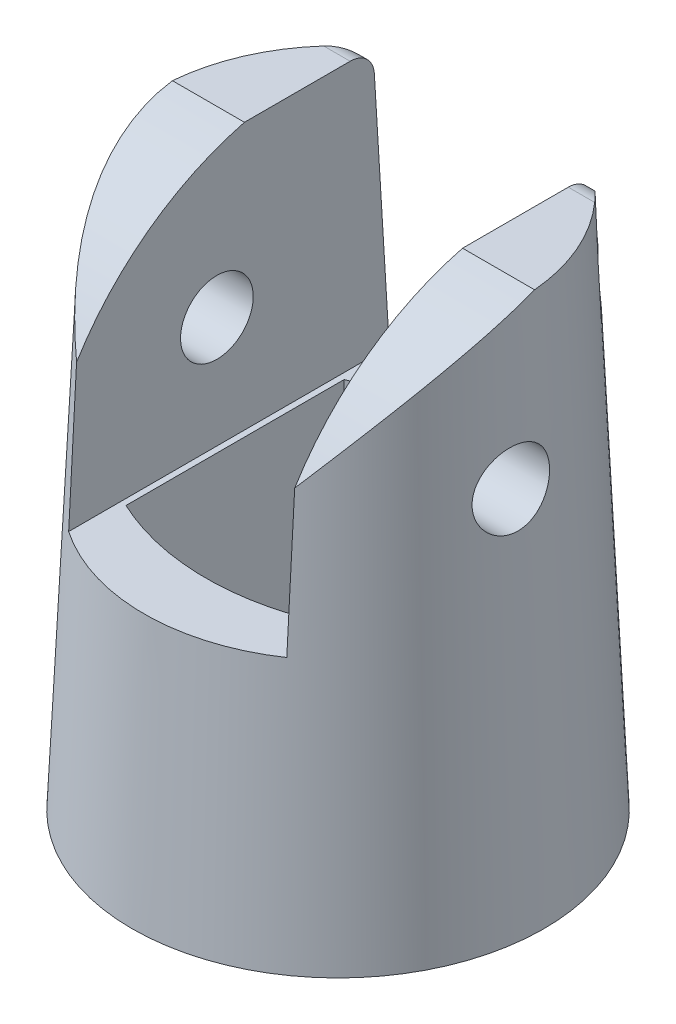
ISO-10303-21;
HEADER;
FILE_DESCRIPTION(('STEP AP214'),'2;1');
FILE_NAME('part.step','',(''),(''),'','','');
FILE_SCHEMA(('AUTOMOTIVE_DESIGN { 1 0 10303 214 1 1 1 1 }'));
ENDSEC;
DATA;
#1=APPLICATION_CONTEXT('core data for automotive mechanical design processes');
#2=APPLICATION_PROTOCOL_DEFINITION('international standard','automotive_design',2000,#1);
#3=PRODUCT_CONTEXT('',#1,'mechanical');
#4=PRODUCT('Part','Part','',(#3));
#5=PRODUCT_RELATED_PRODUCT_CATEGORY('part','',(#4));
#6=PRODUCT_DEFINITION_FORMATION('','',#4);
#7=PRODUCT_DEFINITION_CONTEXT('part definition',#1,'design');
#8=PRODUCT_DEFINITION('design','',#6,#7);
#9=PRODUCT_DEFINITION_SHAPE('','',#8);
#10=(LENGTH_UNIT() NAMED_UNIT(*) SI_UNIT(.MILLI.,.METRE.));
#11=(NAMED_UNIT(*) PLANE_ANGLE_UNIT() SI_UNIT($,.RADIAN.));
#12=(NAMED_UNIT(*) SI_UNIT($,.STERADIAN.) SOLID_ANGLE_UNIT());
#13=UNCERTAINTY_MEASURE_WITH_UNIT(LENGTH_MEASURE(1.E-05),#10,'distance_accuracy_value','');
#14=(GEOMETRIC_REPRESENTATION_CONTEXT(3) GLOBAL_UNCERTAINTY_ASSIGNED_CONTEXT((#13)) GLOBAL_UNIT_ASSIGNED_CONTEXT((#10,
#11,#12)) REPRESENTATION_CONTEXT('',''));
#15=CARTESIAN_POINT('',(0.,0.,0.));
#16=DIRECTION('',(0.,0.,1.));
#17=DIRECTION('',(1.,0.,0.));
#18=AXIS2_PLACEMENT_3D('',#15,#16,#17);
#19=CARTESIAN_POINT('',(0.,18.337,0.));
#20=DIRECTION('',(0.,1.,0.));
#21=DIRECTION('',(0.,0.,1.));
#22=AXIS2_PLACEMENT_3D('',#19,#20,#21);
#23=PLANE('',#22);
#24=DIRECTION('',(0.,0.,-1.));
#25=VECTOR('',#24,1.);
#26=CARTESIAN_POINT('',(-3.75075,18.337,0.));
#27=LINE('',#26,#25);
#28=CARTESIAN_POINT('',(-3.75075,18.337,-0.532854002923822));
#29=VERTEX_POINT('',#28);
#30=CARTESIAN_POINT('',(-3.75075,18.337,-4.16823630481525));
#31=VERTEX_POINT('',#30);
#32=EDGE_CURVE('E241',#29,#31,#27,.T.);
#33=ORIENTED_EDGE('',*,*,#32,.T.);
#34=DIRECTION('',(1.,0.,0.));
#35=VECTOR('',#34,1.);
#36=CARTESIAN_POINT('',(-3.81480374219699,18.337,-4.16823630481525));
#37=LINE('',#36,#35);
#38=CARTESIAN_POINT('',(-4.65874772024692,18.337,-4.16823639152008));
#39=VERTEX_POINT('',#38);
#40=EDGE_CURVE('E12',#31,#39,#37,.F.);
#41=ORIENTED_EDGE('',*,*,#40,.T.);
#42=CARTESIAN_POINT('',(0.,18.337,0.));
#43=DIRECTION('',(0.,1.,0.));
#44=DIRECTION('',(0.,0.,1.));
#45=AXIS2_PLACEMENT_3D('',#42,#43,#44);
#46=CIRCLE('',#45,6.25125);
#47=CARTESIAN_POINT('',(-6.22849846865744,18.337,-0.532854002923822));
#48=VERTEX_POINT('',#47);
#49=EDGE_CURVE('E260',#39,#48,#46,.T.);
#50=ORIENTED_EDGE('',*,*,#49,.T.);
#51=DIRECTION('',(-1.,0.,0.));
#52=VECTOR('',#51,1.);
#53=CARTESIAN_POINT('',(8.335,18.337,-0.532854002923822));
#54=LINE('',#53,#52);
#55=EDGE_CURVE('E222',#29,#48,#54,.T.);
#56=ORIENTED_EDGE('',*,*,#55,.F.);
#57=EDGE_LOOP('',(#33,#41,#50,#56));
#58=FACE_BOUND('',#57,.T.);
#59=ADVANCED_FACE('F38',(#58),#23,.T.);
#60=CARTESIAN_POINT('',(6.22849846865744,18.337,-0.532854002923821));
#61=VERTEX_POINT('',#60);
#62=CARTESIAN_POINT('',(4.65874584385787,18.337,-4.16823703697322));
#63=VERTEX_POINT('',#62);
#64=EDGE_CURVE('E262',#61,#63,#46,.T.);
#65=ORIENTED_EDGE('',*,*,#64,.T.);
#66=DIRECTION('',(1.,0.,0.));
#67=VECTOR('',#66,1.);
#68=CARTESIAN_POINT('',(3.75075,18.337,-4.16823630481525));
#69=LINE('',#68,#67);
#70=CARTESIAN_POINT('',(3.75075,18.337,-4.16823630481525));
#71=VERTEX_POINT('',#70);
#72=EDGE_CURVE('E248',#63,#71,#69,.F.);
#73=ORIENTED_EDGE('',*,*,#72,.T.);
#74=DIRECTION('',(0.,0.,1.));
#75=VECTOR('',#74,1.);
#76=CARTESIAN_POINT('',(3.75075,18.337,0.));
#77=LINE('',#76,#75);
#78=CARTESIAN_POINT('',(3.75075,18.337,-0.532854002923822));
#79=VERTEX_POINT('',#78);
#80=EDGE_CURVE('E233',#71,#79,#77,.T.);
#81=ORIENTED_EDGE('',*,*,#80,.T.);
#82=DIRECTION('',(-1.,0.,0.));
#83=VECTOR('',#82,1.);
#84=CARTESIAN_POINT('',(8.335,18.337,-0.532854002923822));
#85=LINE('',#84,#83);
#86=EDGE_CURVE('E184',#61,#79,#85,.T.);
#87=ORIENTED_EDGE('',*,*,#86,.F.);
#88=EDGE_LOOP('',(#65,#73,#81,#87));
#89=FACE_BOUND('',#88,.T.);
#90=ADVANCED_FACE('F298',(#89),#23,.T.);
#91=CARTESIAN_POINT('',(0.,18.337,0.));
#92=DIRECTION('',(0.,-1.,0.));
#93=DIRECTION('',(0.,0.,-1.));
#94=AXIS2_PLACEMENT_3D('',#91,#92,#93);
#95=CONICAL_SURFACE('',#94,6.25125,0.0454232794215771);
#96=CARTESIAN_POINT('',(-6.51773858094387,12.1114481671636,-0.463940332273538));
#97=CARTESIAN_POINT('',(-6.52346201650118,12.0627389343408,-0.414709493364169));
#98=CARTESIAN_POINT('',(-6.52872743198099,12.0180812923324,-0.361374406852615));
#99=CARTESIAN_POINT('',(-6.5376546479485,11.9381508600028,-0.247921755653941));
#100=CARTESIAN_POINT('',(-6.54131544441458,11.9028839509315,-0.187799973980439));
#101=CARTESIAN_POINT('',(-6.54644472691235,11.8427757457658,-0.0624172860844871));
#102=CARTESIAN_POINT('',(-6.5479120855907,11.8179398155559,0.00284624469731699));
#103=CARTESIAN_POINT('',(-6.54823601897027,11.7794718116996,0.136590001722689));
#104=CARTESIAN_POINT('',(-6.54709318119288,11.7658372177169,0.20506950069528));
#105=CARTESIAN_POINT('',(-6.54205214469408,11.7502417109362,0.342345880170515));
#106=CARTESIAN_POINT('',(-6.53818964342586,11.7481326265347,0.411127298368737));
#107=CARTESIAN_POINT('',(-6.52782935176699,11.7551737974795,0.547907473966542));
#108=CARTESIAN_POINT('',(-6.52133147644231,11.7643244157279,0.615906206068719));
#109=CARTESIAN_POINT('',(-6.50600567564156,11.7935520440776,0.749413995722807));
#110=CARTESIAN_POINT('',(-6.49717190166806,11.8136566159941,0.814916325235114));
#111=CARTESIAN_POINT('',(-6.47771461221596,11.864146853557,0.941544405329176));
#112=CARTESIAN_POINT('',(-6.46709083492051,11.8945340238557,1.00266951380535));
#113=CARTESIAN_POINT('',(-6.44443539040625,11.9656668304325,1.12060385223055));
#114=CARTESIAN_POINT('',(-6.43237343301595,12.00667022172,1.17725179339884));
#115=CARTESIAN_POINT('',(-6.4079279839484,12.0974889184329,1.28290689315987));
#116=CARTESIAN_POINT('',(-6.39554443755851,12.147305731796,1.33191274152021));
#117=CARTESIAN_POINT('',(-6.37107268357767,12.2557058700908,1.42202961804798));
#118=CARTESIAN_POINT('',(-6.35899758550603,12.3144627082632,1.46293589594525));
#119=CARTESIAN_POINT('',(-6.33638242418359,12.4383183603351,1.53423088445911));
#120=CARTESIAN_POINT('',(-6.3258422683769,12.5034167914457,1.56462022939126));
#121=CARTESIAN_POINT('',(-6.30723889243806,12.6373991871977,1.61360281673714));
#122=CARTESIAN_POINT('',(-6.29914889609969,12.7062317509697,1.63232613329956));
#123=CARTESIAN_POINT('',(-6.28590409461516,12.8463477696423,1.65781101802605));
#124=CARTESIAN_POINT('',(-6.28074855533483,12.9176306068042,1.66457557889041));
#125=CARTESIAN_POINT('',(-6.27381957970005,13.0580202975343,1.66580701498382));
#126=CARTESIAN_POINT('',(-6.27193666266841,13.1271183342982,1.66068594519533));
#127=CARTESIAN_POINT('',(-6.27120254184775,13.2635322585303,1.6391038544184));
#128=CARTESIAN_POINT('',(-6.27235108842604,13.3308482922805,1.62264376724938));
#129=CARTESIAN_POINT('',(-6.27733536397242,13.4607874180262,1.57920898357936));
#130=CARTESIAN_POINT('',(-6.28113166636361,13.5234646266275,1.55239110245949));
#131=CARTESIAN_POINT('',(-6.29084550036924,13.6435109287022,1.48902908006572));
#132=CARTESIAN_POINT('',(-6.29676324491185,13.7008794886216,1.45248396256847));
#133=CARTESIAN_POINT('',(-6.3101762217852,13.8098600851296,1.36991653247821));
#134=CARTESIAN_POINT('',(-6.31769915744943,13.8613428150458,1.32372813908212));
#135=CARTESIAN_POINT('',(-6.33347712643706,13.9559587600214,1.22357557294775));
#136=CARTESIAN_POINT('',(-6.34173226102221,13.999090817565,1.16961032403817));
#137=CARTESIAN_POINT('',(-6.35840551811847,14.076806808086,1.05396241034032));
#138=CARTESIAN_POINT('',(-6.36682288330067,14.1111646995605,0.992127532863705));
#139=CARTESIAN_POINT('',(-6.38289030682766,14.1690053214479,0.863469865102199));
#140=CARTESIAN_POINT('',(-6.39054036213801,14.1924880088541,0.796647055093494));
#141=CARTESIAN_POINT('',(-6.40449905695037,14.2278834178185,0.659793964550788));
#142=CARTESIAN_POINT('',(-6.4108063835421,14.2397848555414,0.589760625344246));
#143=CARTESIAN_POINT('',(-6.4216940257831,14.251562411186,0.448558519073894));
#144=CARTESIAN_POINT('',(-6.42627449682104,14.2514396113512,0.377389854771712));
#145=CARTESIAN_POINT('',(-6.43352797621875,14.239202695135,0.23700396438377));
#146=CARTESIAN_POINT('',(-6.4362268527317,14.2272568955501,0.167773368732041));
#147=CARTESIAN_POINT('',(-6.4399381842833,14.1919360186339,0.0322461446703179));
#148=CARTESIAN_POINT('',(-6.44095068147891,14.1685612270292,-0.0340505570423018));
#149=CARTESIAN_POINT('',(-6.44162216860399,14.1112035276987,-0.161447885826772));
#150=CARTESIAN_POINT('',(-6.44128856761486,14.0772796346242,-0.22257507059119));
#151=CARTESIAN_POINT('',(-6.43977702726877,13.9997384842744,-0.338325566823852));
#152=CARTESIAN_POINT('',(-6.43859905079352,13.9561208009235,-0.392948592249569));
#153=CARTESIAN_POINT('',(-6.43597784587503,13.8601098215506,-0.494488109929926));
#154=CARTESIAN_POINT('',(-6.43453301177812,13.8076635840204,-0.541354508741275));
#155=CARTESIAN_POINT('',(-6.43200031904136,13.6956586401061,-0.625649506385511));
#156=CARTESIAN_POINT('',(-6.43091246352704,13.6360998714544,-0.66307802258438));
#157=CARTESIAN_POINT('',(-6.42964749927842,13.5113875487815,-0.727519149997922));
#158=CARTESIAN_POINT('',(-6.42947270499469,13.4462202021306,-0.754505131223534));
#159=CARTESIAN_POINT('',(-6.43045974377544,13.312291476501,-0.797149362811549));
#160=CARTESIAN_POINT('',(-6.43162148100935,13.2435303555366,-0.812808425193493));
#161=CARTESIAN_POINT('',(-6.43548633556856,13.1047888638129,-0.832307431818391));
#162=CARTESIAN_POINT('',(-6.43818079671533,13.03481746187,-0.836212982297265));
#163=CARTESIAN_POINT('',(-6.44508243623281,12.8952673969015,-0.832309201093481));
#164=CARTESIAN_POINT('',(-6.44928985075968,12.8256887969113,-0.824498039950963));
#165=CARTESIAN_POINT('',(-6.45896019162065,12.6888662359675,-0.797417745810617));
#166=CARTESIAN_POINT('',(-6.46442364015944,12.6216232594875,-0.778143841795413));
#167=CARTESIAN_POINT('',(-6.4761393936595,12.4913761915306,-0.728711508105946));
#168=CARTESIAN_POINT('',(-6.48239117891515,12.4283693489876,-0.698560225120254));
#169=CARTESIAN_POINT('',(-6.49367927668362,12.3214247030321,-0.635937270246686));
#170=CARTESIAN_POINT('',(-6.49868252532983,12.276329354284,-0.605413833836998));
#171=CARTESIAN_POINT('',(-6.50846424888148,12.1904720510239,-0.538751218579178));
#172=CARTESIAN_POINT('',(-6.51324272271478,12.1497101171805,-0.502612012948363));
#173=CARTESIAN_POINT('',(-6.51773858094387,12.1114481671636,-0.463940332273538));
#174=B_SPLINE_CURVE_WITH_KNOTS('',3,(#96,#97,#98,#99,#100,#101,#102,#103,#104,#105,#106,#107,
#108,#109,#110,#111,#112,#113,#114,#115,#116,#117,#118,#119,#120,#121,#122,#123,#124,#125,#126,
#127,#128,#129,#130,#131,#132,#133,#134,#135,#136,#137,#138,#139,#140,#141,#142,#143,#144,#145,
#146,#147,#148,#149,#150,#151,#152,#153,#154,#155,#156,#157,#158,#159,#160,#161,#162,#163,#164,
#165,#166,#167,#168,#169,#170,#171,#172,#173),.UNSPECIFIED.,.T.,.F.,(4,2,2,2,2,2,2,2,2,2,2,2,2,
2,2,2,2,2,2,2,2,2,2,2,2,2,2,2,2,2,2,2,2,2,2,2,2,2,4),(0.,0.208281614863982,0.416693367638343,
0.625212200267069,0.833684102634483,1.03946947848675,1.24526148701074,1.45157370701979,
1.65791612975415,1.86983521107779,2.08179058595372,2.29856332946363,2.51532299631948,
2.72962042644132,2.94386422064711,3.15079198749445,3.35770271494055,3.56159643272432,
3.76551062095855,3.97327919280535,4.18107654359351,4.3937834661333,4.60649122982617,
4.81940603191024,5.03230167057709,5.24220941693708,5.45211191583881,5.66086066724026,
5.86961859568999,6.07967613180325,6.28973550702564,6.50032708855674,6.71090357141592,
6.92030244921415,7.12973402618031,7.33925283372311,7.54863423254342,7.71224228521852,
7.87585111819585),.UNSPECIFIED.);
#175=CARTESIAN_POINT('',(-6.51773858094387,12.1114481671636,-0.463940332273538));
#176=VERTEX_POINT('',#175);
#177=EDGE_CURVE('E396',#176,#176,#174,.T.);
#178=ORIENTED_EDGE('',*,*,#177,.F.);
#179=EDGE_LOOP('',(#178));
#180=FACE_BOUND('',#179,.T.);
#181=CARTESIAN_POINT('',(6.51773858094387,12.1114481671636,-0.463940332273538));
#182=CARTESIAN_POINT('',(6.51191462147258,12.1610126416727,-0.514029047130319));
#183=CARTESIAN_POINT('',(6.50561117090751,12.2148195930958,-0.559916547612873));
#184=CARTESIAN_POINT('',(6.49279177843099,12.3294071181411,-0.642001751930643));
#185=CARTESIAN_POINT('',(6.48627564105307,12.3901942437655,-0.678190243730383));
#186=CARTESIAN_POINT('',(6.47373255783331,12.5170269690946,-0.739828051398911));
#187=CARTESIAN_POINT('',(6.46770550557997,12.5830714187219,-0.765279708395058));
#188=CARTESIAN_POINT('',(6.4567133452763,12.7185716689284,-0.80469891540568));
#189=CARTESIAN_POINT('',(6.45174796436432,12.7880265873218,-0.818669418838713));
#190=CARTESIAN_POINT('',(6.44327925019297,12.9280900045569,-0.834660346529417));
#191=CARTESIAN_POINT('',(6.4397698246375,12.9986923850743,-0.83673104198345));
#192=CARTESIAN_POINT('',(6.43433097134465,13.1393007907243,-0.828957629462131));
#193=CARTESIAN_POINT('',(6.43240152028812,13.2093068246435,-0.819113697342334));
#194=CARTESIAN_POINT('',(6.43003356826119,13.3460679658221,-0.787917683340702));
#195=CARTESIAN_POINT('',(6.42958186058639,13.4128465848768,-0.766669526357875));
#196=CARTESIAN_POINT('',(6.42981409918339,13.5419215415848,-0.713332112832372));
#197=CARTESIAN_POINT('',(6.43049806928855,13.6042177851422,-0.681242628784543));
#198=CARTESIAN_POINT('',(6.43251561199066,13.7226907186565,-0.607057465946235));
#199=CARTESIAN_POINT('',(6.43385043491624,13.7788553742469,-0.564942607812348));
#200=CARTESIAN_POINT('',(6.43657804782386,13.8833585637079,-0.471920459317438));
#201=CARTESIAN_POINT('',(6.43797083948051,13.931696871293,-0.421012914818983));
#202=CARTESIAN_POINT('',(6.44020508697017,14.0194033206778,-0.311563586923005));
#203=CARTESIAN_POINT('',(6.44104386213306,14.0587272557427,-0.252986304653429));
#204=CARTESIAN_POINT('',(6.44159435897117,14.1269801387651,-0.13005528327408));
#205=CARTESIAN_POINT('',(6.44130612689178,14.1559095131977,-0.0657017812904194));
#206=CARTESIAN_POINT('',(6.43917770202648,14.2024455809386,0.0666468770275328));
#207=CARTESIAN_POINT('',(6.43734408598523,14.2200996999736,0.134625459396501));
#208=CARTESIAN_POINT('',(6.43190428454353,14.2437913732752,0.272506167682637));
#209=CARTESIAN_POINT('',(6.4282981717992,14.2498294036451,0.342408214644525));
#210=CARTESIAN_POINT('',(6.41933921277659,14.2501626266076,0.481769826876516));
#211=CARTESIAN_POINT('',(6.41399526537848,14.2445168742435,0.551229846080074));
#212=CARTESIAN_POINT('',(6.40179363603949,14.2218243316732,0.688123496957203));
#213=CARTESIAN_POINT('',(6.39493587120932,14.2047769170637,0.755557017439756));
#214=CARTESIAN_POINT('',(6.38009678947474,14.1596258460059,0.887100537820638));
#215=CARTESIAN_POINT('',(6.3721068062279,14.1314335873398,0.951179125223652));
#216=CARTESIAN_POINT('',(6.35568136751719,14.0647999785722,1.07370696151684));
#217=CARTESIAN_POINT('',(6.34724586367684,14.0263575136185,1.13215559712964));
#218=CARTESIAN_POINT('',(6.33057360953266,13.93967160602,1.24260162195053));
#219=CARTESIAN_POINT('',(6.32234103393588,13.8913038005145,1.29450213112912));
#220=CARTESIAN_POINT('',(6.30703602677204,13.7863913238949,1.38946463942664));
#221=CARTESIAN_POINT('',(6.2999635746748,13.7298467975138,1.43252679495742));
#222=CARTESIAN_POINT('',(6.28782529316964,13.6104348882181,1.5083393214685));
#223=CARTESIAN_POINT('',(6.2827492583795,13.5476017779544,1.54114195635682));
#224=CARTESIAN_POINT('',(6.27523269875716,13.4171655774094,1.59570232647728));
#225=CARTESIAN_POINT('',(6.27279164254975,13.3495634517882,1.61746228812853));
#226=CARTESIAN_POINT('',(6.2710190886678,13.2133925249197,1.64882995451448));
#227=CARTESIAN_POINT('',(6.27160916498816,13.1448934004239,1.65873605347492));
#228=CARTESIAN_POINT('',(6.27585543603687,13.0072985704463,1.66712716741035));
#229=CARTESIAN_POINT('',(6.27951135788827,12.9382029186004,1.66561319873767));
#230=CARTESIAN_POINT('',(6.28965280949152,12.8023299231397,1.65138586351135));
#231=CARTESIAN_POINT('',(6.29610016315767,12.7355339855775,1.63882131584172));
#232=CARTESIAN_POINT('',(6.31139104404244,12.6051067287363,1.60316066268051));
#233=CARTESIAN_POINT('',(6.32023483723045,12.5414757616506,1.58006338801732));
#234=CARTESIAN_POINT('',(6.33990495398142,12.4176874568732,1.52346561478718));
#235=CARTESIAN_POINT('',(6.35076935545988,12.357632446846,1.48975481372243));
#236=CARTESIAN_POINT('',(6.3735618519694,12.2439842356231,1.4130685437844));
#237=CARTESIAN_POINT('',(6.38549015805941,12.1903923215682,1.37009123419989));
#238=CARTESIAN_POINT('',(6.40996360957956,12.0893346598637,1.27442799456759));
#239=CARTESIAN_POINT('',(6.42251612695209,12.0421290866719,1.2214687317946));
#240=CARTESIAN_POINT('',(6.44693379072675,11.9572725099995,1.10823306537629));
#241=CARTESIAN_POINT('',(6.45879889318743,11.9196221167935,1.04795619473006));
#242=CARTESIAN_POINT('',(6.48106161225194,11.854780224185,0.921277853162437));
#243=CARTESIAN_POINT('',(6.49144981769934,11.8276540468456,0.854841204951657));
#244=CARTESIAN_POINT('',(6.50994888896016,11.7851090471817,0.718019863402462));
#245=CARTESIAN_POINT('',(6.51806021420877,11.7696878619198,0.647635969994099));
#246=CARTESIAN_POINT('',(6.5313300812704,11.7513941804253,0.506853542256299));
#247=CARTESIAN_POINT('',(6.5365596765631,11.7482069364241,0.43650262671152));
#248=CARTESIAN_POINT('',(6.54417211762386,11.7537104837945,0.296102406303499));
#249=CARTESIAN_POINT('',(6.54655492815615,11.762401422184,0.226053105184148));
#250=CARTESIAN_POINT('',(6.5485175934788,11.7910968885324,0.0900228178118079));
#251=CARTESIAN_POINT('',(6.54816266768297,11.810827845851,0.0239847231193284));
#252=CARTESIAN_POINT('',(6.54510936361899,11.8608259366875,-0.103871399215762));
#253=CARTESIAN_POINT('',(6.54241282904005,11.8910847697455,-0.165692705695682));
#254=CARTESIAN_POINT('',(6.53612544184396,11.952069711937,-0.268059367410935));
#255=CARTESIAN_POINT('',(6.53295125761917,11.9806157028099,-0.309948512929147));
#256=CARTESIAN_POINT('',(6.52584648343601,12.0425295634542,-0.389925742511345));
#257=CARTESIAN_POINT('',(6.52191587201752,12.0758975700213,-0.428013718688179));
#258=CARTESIAN_POINT('',(6.51773858094387,12.1114481671636,-0.463940332273538));
#259=B_SPLINE_CURVE_WITH_KNOTS('',3,(#181,#182,#183,#184,#185,#186,#187,#188,#189,#190,#191,
#192,#193,#194,#195,#196,#197,#198,#199,#200,#201,#202,#203,#204,#205,#206,#207,#208,#209,#210,
#211,#212,#213,#214,#215,#216,#217,#218,#219,#220,#221,#222,#223,#224,#225,#226,#227,#228,#229,
#230,#231,#232,#233,#234,#235,#236,#237,#238,#239,#240,#241,#242,#243,#244,#245,#246,#247,#248,
#249,#250,#251,#252,#253,#254,#255,#256,#257,#258),.UNSPECIFIED.,.T.,.F.,(4,2,2,2,2,2,2,2,2,2,2,
2,2,2,2,2,2,2,2,2,2,2,2,2,2,2,2,2,2,2,2,2,2,2,2,2,2,2,4),(0.,0.211936179350064,
0.424072946193582,0.636163433456402,0.848199345347396,1.05933884111939,1.27047522058746,
1.47971942796188,1.68896802659691,1.8986201980231,2.10827843009796,2.31894382668903,
2.5296005789692,2.73936533250528,2.94912148832644,3.15782003291247,3.36653000765202,
3.57693373049255,3.78736034700402,4.00060506050217,4.21384599989493,4.4259822577381,
4.63807572774863,4.8447096783874,5.051325239431,5.2552001834279,5.45909776380759,
5.66732089367116,5.8755854234151,6.09071512429112,6.30585856170964,6.52231677485167,
6.73873127900622,6.94953914807951,7.16034962637706,7.36615388335403,7.57179624505517,
7.72380519956868,7.87581846726857),.UNSPECIFIED.);
#260=CARTESIAN_POINT('',(6.51773858094387,12.1114481671636,-0.463940332273538));
#261=VERTEX_POINT('',#260);
#262=EDGE_CURVE('E398',#261,#261,#259,.T.);
#263=ORIENTED_EDGE('',*,*,#262,.F.);
#264=EDGE_LOOP('',(#263));
#265=FACE_BOUND('',#264,.T.);
#266=CARTESIAN_POINT('',(0.,29.5319950274736,-4.26759958312926));
#267=DIRECTION('',(0.,-0.0610485395348537,0.998134798421867));
#268=DIRECTION('',(0.,-0.998134798421867,-0.0610485395348537));
#269=AXIS2_PLACEMENT_3D('',#266,#267,#268);
#270=ELLIPSE('',#269,94.0626366070842,3.84221258433015);
#271=CARTESIAN_POINT('',(3.81081783175187,17.5543839577023,-5.00018165929988));
#272=VERTEX_POINT('',#271);
#273=CARTESIAN_POINT('',(3.75075,9.1685,-5.51308429443084));
#274=VERTEX_POINT('',#273);
#275=EDGE_CURVE('E168',#272,#274,#270,.F.);
#276=ORIENTED_EDGE('',*,*,#275,.F.);
#277=CARTESIAN_POINT('',(3.81081783175187,17.5543839577023,-5.00018165929988));
#278=CARTESIAN_POINT('',(3.81090488241183,17.5720495122814,-4.99910484961112));
#279=CARTESIAN_POINT('',(3.81174500986489,17.5896618917567,-4.99745875062722));
#280=CARTESIAN_POINT('',(3.81486515058484,17.6245951126813,-4.9930796190026));
#281=CARTESIAN_POINT('',(3.81714293758739,17.6419163624557,-4.99034826932762));
#282=CARTESIAN_POINT('',(3.8259560492316,17.6927769982478,-4.98068539771796));
#283=CARTESIAN_POINT('',(3.83447760612131,17.725707670075,-4.97225234654264));
#284=CARTESIAN_POINT('',(3.8558034176206,17.7887629390512,-4.95210015403707));
#285=CARTESIAN_POINT('',(3.86858290125357,17.8189025068096,-4.94040008130068));
#286=CARTESIAN_POINT('',(3.89744224799824,17.8764174985736,-4.91432961722499));
#287=CARTESIAN_POINT('',(3.91353411645856,17.9037823116157,-4.89994953094967));
#288=CARTESIAN_POINT('',(3.95868292480326,17.9714950413432,-4.85966281035462));
#289=CARTESIAN_POINT('',(3.98965491008717,18.0095622767793,-4.83208110406427));
#290=CARTESIAN_POINT('',(4.0552774003084,18.0788665880388,-4.7730130524059));
#291=CARTESIAN_POINT('',(4.08993695766782,18.1100862515056,-4.74151706469858));
#292=CARTESIAN_POINT('',(4.17715982719718,18.1786831682867,-4.66094104184353));
#293=CARTESIAN_POINT('',(4.23087181824555,18.2126937422426,-4.61023684604291));
#294=CARTESIAN_POINT('',(4.33989399387741,18.2686228706133,-4.50423288817117));
#295=CARTESIAN_POINT('',(4.39520408186324,18.2905421542891,-4.44893340348683));
#296=CARTESIAN_POINT('',(4.48550162096461,18.3164994011473,-4.35575415030649));
#297=CARTESIAN_POINT('',(4.52053329928853,18.3241443027824,-4.31888900758306));
#298=CARTESIAN_POINT('',(4.59008115742119,18.334377988235,-4.24421806182253));
#299=CARTESIAN_POINT('',(4.6245986427257,18.336983126256,-4.20641570592538));
#300=CARTESIAN_POINT('',(4.65874666217656,18.3369999999987,-4.16823776914891));
#301=B_SPLINE_CURVE_WITH_KNOTS('',3,(#277,#278,#279,#280,#281,#282,#283,#284,#285,#286,#287,
#288,#289,#290,#291,#292,#293,#294,#295,#296,#297,#298,#299,#300),.UNSPECIFIED.,.F.,.F.,(4,2,2,
2,2,2,2,2,2,2,2,4),(0.,0.0530448190436317,0.106007697250879,0.210474462783002,0.314343794470987,
0.418596434934597,0.58653468684183,0.754895153282479,0.997585572135528,1.24026135202115,
1.39430183491148,1.54784160716217),.UNSPECIFIED.);
#302=EDGE_CURVE('E251',#272,#63,#301,.T.);
#303=ORIENTED_EDGE('',*,*,#302,.T.);
#304=ORIENTED_EDGE('',*,*,#64,.F.);
#305=CARTESIAN_POINT('',(3.49394177515797,13.7525833,5.43315966129922));
#306=CARTESIAN_POINT('',(3.64092722935138,13.938554527761,5.32855630629834));
#307=CARTESIAN_POINT('',(3.78527267221186,14.1227072011883,5.21683839059782));
#308=CARTESIAN_POINT('',(4.06757681741539,14.4866949465275,4.97854220852965));
#309=CARTESIAN_POINT('',(4.20552705424609,14.6665241519196,4.85194498751597));
#310=CARTESIAN_POINT('',(4.47486016104997,15.0224336022434,4.58221261076328));
#311=CARTESIAN_POINT('',(4.60616555546869,15.1984599411938,4.43892774395855));
#312=CARTESIAN_POINT('',(4.85896380695773,15.5435723241917,4.13654635028863));
#313=CARTESIAN_POINT('',(4.98046151543991,15.712661778987,3.97745772876973));
#314=CARTESIAN_POINT('',(5.28353942525262,16.1449482831168,3.53923865193593));
#315=CARTESIAN_POINT('',(5.45578153475187,16.4016400982212,3.24673840242429));
#316=CARTESIAN_POINT('',(5.68302989361309,16.7642221444474,2.77675909015117));
#317=CARTESIAN_POINT('',(5.75353472345106,16.8812270626578,2.61508398873957));
#318=CARTESIAN_POINT('',(5.88279084190036,17.1068548595315,2.28145856226977));
#319=CARTESIAN_POINT('',(5.94154506610348,17.2154798275376,2.10951081754771));
#320=CARTESIAN_POINT('',(6.03601842832892,17.4039409867676,1.78863848833547));
#321=CARTESIAN_POINT('',(6.07398754462993,17.4853909748198,1.64131967380258));
#322=CARTESIAN_POINT('',(6.14005703300154,17.6412068677888,1.34084929437422));
#323=CARTESIAN_POINT('',(6.16815968294512,17.7155744049393,1.18769908483643));
#324=CARTESIAN_POINT('',(6.21353161079843,17.8564429832867,0.876577898811864));
#325=CARTESIAN_POINT('',(6.23081978271889,17.9229575784575,0.718615838505849));
#326=CARTESIAN_POINT('',(6.25375882641362,18.0476304413374,0.398665317074399));
#327=CARTESIAN_POINT('',(6.25941640477043,18.1057935068038,0.23667923090876));
#328=CARTESIAN_POINT('',(6.25856261023482,18.1925444466948,-0.0270658115020043));
#329=CARTESIAN_POINT('',(6.25590382441074,18.2238855616,-0.127951041573981));
#330=CARTESIAN_POINT('',(6.24578494769915,18.283147699573,-0.330431531182641));
#331=CARTESIAN_POINT('',(6.23832703253647,18.3110702656437,-0.432026448342051));
#332=CARTESIAN_POINT('',(6.22840170159267,18.3372556830975,-0.533847827278967));
#333=B_SPLINE_CURVE_WITH_KNOTS('',3,(#305,#306,#307,#308,#309,#310,#311,#312,#313,#314,#315,
#316,#317,#318,#319,#320,#321,#322,#323,#324,#325,#326,#327,#328,#329,#330,#331,#332),
.UNSPECIFIED.,.F.,.F.,(4,2,2,2,2,2,2,2,2,2,2,2,2,4),(0.,0.777274671455002,1.55555046458655,
2.34144216130315,3.12694270047946,4.39845905239948,5.03286202551173,5.66710631055391,
6.18432626837507,6.70142673687993,7.21762123553065,7.73351799588035,8.05038912972475,
8.36711670854254),.UNSPECIFIED.);
#334=CARTESIAN_POINT('',(3.75075,14.0791547070903,5.24091330276178));
#335=VERTEX_POINT('',#334);
#336=EDGE_CURVE('E182',#335,#61,#333,.T.);
#337=ORIENTED_EDGE('',*,*,#336,.F.);
#338=CARTESIAN_POINT('',(3.75075,-1.07387220487571,6.06791451540447));
#339=CARTESIAN_POINT('',(3.75075,1.01598627000296,5.95622122053329));
#340=CARTESIAN_POINT('',(3.75075,3.10580153777455,5.84371010790543));
#341=CARTESIAN_POINT('',(3.75075,7.28533140127586,5.61666169999787));
#342=CARTESIAN_POINT('',(3.75075,9.37504599650854,5.50212439557397));
#343=CARTESIAN_POINT('',(3.75075,12.5095177466738,5.32850663120666));
#344=CARTESIAN_POINT('',(3.75075,13.5543250759218,5.27033206930588));
#345=CARTESIAN_POINT('',(3.75075,15.643901728463,5.15331265044886));
#346=CARTESIAN_POINT('',(3.75075,16.6886710517731,5.09446779379698));
#347=CARTESIAN_POINT('',(3.75075,18.7781636706516,4.97603705567505));
#348=CARTESIAN_POINT('',(3.75075,19.8228869663835,4.91645117709314));
#349=CARTESIAN_POINT('',(3.75075,21.9122874622495,4.79644971429636));
#350=CARTESIAN_POINT('',(3.75075,22.9569646623074,4.73603412875425));
#351=CARTESIAN_POINT('',(3.75075,26.7242074714716,4.51650927281044));
#352=CARTESIAN_POINT('',(3.75075,29.446620005384,4.35474518993917));
#353=CARTESIAN_POINT('',(3.75075,33.5298340612067,4.10559680459857));
#354=CARTESIAN_POINT('',(3.75075,34.8908341524625,4.02146387686822));
#355=CARTESIAN_POINT('',(3.75075,37.6126711333528,3.85056871821084));
#356=CARTESIAN_POINT('',(3.75075,38.9735080228156,3.76380648454264));
#357=CARTESIAN_POINT('',(3.75075,41.6950219762516,3.58705922431988));
#358=CARTESIAN_POINT('',(3.75075,43.0556990327228,3.49707408204862));
#359=CARTESIAN_POINT('',(3.75075,45.7767776731049,3.3130679972063));
#360=CARTESIAN_POINT('',(3.75074999999999,47.1371792578267,3.21904706669472));
#361=CARTESIAN_POINT('',(3.75074999999999,49.1775186219031,3.07408611290007));
#362=CARTESIAN_POINT('',(3.75074999999999,49.8575960234979,3.02511026060942));
#363=CARTESIAN_POINT('',(3.75074999999999,51.2176391931532,2.92563757934034));
#364=CARTESIAN_POINT('',(3.75074999999999,51.8976049613051,2.87514075161304));
#365=CARTESIAN_POINT('',(3.75074999999999,53.2574099473586,2.77237757771944));
#366=CARTESIAN_POINT('',(3.75074999999999,53.9372491639404,2.72011121403653));
#367=CARTESIAN_POINT('',(3.75074999999999,55.2967630003423,2.61345802095606));
#368=CARTESIAN_POINT('',(3.75074999999999,55.9764376196909,2.5590711855544));
#369=CARTESIAN_POINT('',(3.75074999999999,56.6560123593918,2.50344855029634));
#370=B_SPLINE_CURVE_WITH_KNOTS('',3,(#338,#339,#340,#341,#342,#343,#344,#345,#346,#347,#348,
#349,#350,#351,#352,#353,#354,#355,#356,#357,#358,#359,#360,#361,#362,#363,#364,#365,#366,#367,
#368,#369),.UNSPECIFIED.,.F.,.F.,(4,2,2,2,2,2,2,2,2,2,2,2,2,2,2,4),(0.,6.27852391818669,
12.5570761786104,15.6963529276504,18.8356282512397,21.9748913432767,25.1141594576031,
33.2957897085008,37.3865819680015,41.4773784924688,45.5683220421761,49.6592533684477,
51.7047678621044,53.7502806732118,55.7958137387459,57.8413525965972),.UNSPECIFIED.);
#371=CARTESIAN_POINT('',(3.75075,9.1685,5.51308429443084));
#372=VERTEX_POINT('',#371);
#373=EDGE_CURVE('E320',#335,#372,#370,.F.);
#374=ORIENTED_EDGE('',*,*,#373,.T.);
#375=CARTESIAN_POINT('',(0.,9.1685,0.));
#376=DIRECTION('',(0.,1.,0.));
#377=DIRECTION('',(0.,0.,1.));
#378=AXIS2_PLACEMENT_3D('',#375,#376,#377);
#379=CIRCLE('',#378,6.668);
#380=CARTESIAN_POINT('',(-3.75075,9.1685,5.51308429443084));
#381=VERTEX_POINT('',#380);
#382=EDGE_CURVE('E323',#372,#381,#379,.F.);
#383=ORIENTED_EDGE('',*,*,#382,.T.);
#384=CARTESIAN_POINT('',(-3.75075,-1.07387220487571,6.06791451540447));
#385=CARTESIAN_POINT('',(-3.75075,1.01598627000297,5.95622122053329));
#386=CARTESIAN_POINT('',(-3.75075,3.10580153777455,5.84371010790542));
#387=CARTESIAN_POINT('',(-3.75075,7.28533140127586,5.61666169999787));
#388=CARTESIAN_POINT('',(-3.75075,9.37504599650855,5.50212439557396));
#389=CARTESIAN_POINT('',(-3.75075,12.5095177466738,5.32850663120665));
#390=CARTESIAN_POINT('',(-3.75075,13.5543250759218,5.27033206930588));
#391=CARTESIAN_POINT('',(-3.75075,15.643901728463,5.15331265044885));
#392=CARTESIAN_POINT('',(-3.75075,16.6886710517731,5.09446779379698));
#393=CARTESIAN_POINT('',(-3.75075,18.7781636706516,4.97603705567505));
#394=CARTESIAN_POINT('',(-3.75075,19.8228869663835,4.91645117709314));
#395=CARTESIAN_POINT('',(-3.75075,21.9122874622496,4.79644971429635));
#396=CARTESIAN_POINT('',(-3.75075,22.9569646623074,4.73603412875424));
#397=CARTESIAN_POINT('',(-3.75075,26.7242074714716,4.51650927281043));
#398=CARTESIAN_POINT('',(-3.75075,29.446620005384,4.35474518993917));
#399=CARTESIAN_POINT('',(-3.75075,33.5298340612066,4.10559680459856));
#400=CARTESIAN_POINT('',(-3.75075,34.8908341524625,4.02146387686821));
#401=CARTESIAN_POINT('',(-3.75075,37.6126711333527,3.85056871821083));
#402=CARTESIAN_POINT('',(-3.75075,38.9735080228155,3.76380648454263));
#403=CARTESIAN_POINT('',(-3.75075,41.6950219762516,3.58705922431987));
#404=CARTESIAN_POINT('',(-3.75075,43.0556990327228,3.49707408204861));
#405=CARTESIAN_POINT('',(-3.75075,45.7767776731049,3.31306799720629));
#406=CARTESIAN_POINT('',(-3.75075000000001,47.1371792578267,3.21904706669471));
#407=CARTESIAN_POINT('',(-3.75075000000001,49.1775186219031,3.07408611290006));
#408=CARTESIAN_POINT('',(-3.75075000000001,49.8575960234979,3.02511026060941));
#409=CARTESIAN_POINT('',(-3.75075000000001,51.2176391931532,2.92563757934033));
#410=CARTESIAN_POINT('',(-3.75075000000001,51.8976049613051,2.87514075161302));
#411=CARTESIAN_POINT('',(-3.75075000000001,53.2574099473586,2.77237757771942));
#412=CARTESIAN_POINT('',(-3.75075000000001,53.9372491639404,2.72011121403652));
#413=CARTESIAN_POINT('',(-3.75075000000001,55.2967630003423,2.61345802095604));
#414=CARTESIAN_POINT('',(-3.75075000000001,55.9764376196909,2.55907118555438));
#415=CARTESIAN_POINT('',(-3.75075000000001,56.6560123593918,2.50344855029632));
#416=B_SPLINE_CURVE_WITH_KNOTS('',3,(#384,#385,#386,#387,#388,#389,#390,#391,#392,#393,#394,
#395,#396,#397,#398,#399,#400,#401,#402,#403,#404,#405,#406,#407,#408,#409,#410,#411,#412,#413,
#414,#415),.UNSPECIFIED.,.F.,.F.,(4,2,2,2,2,2,2,2,2,2,2,2,2,2,2,4),(0.,6.27852391818668,
12.5570761786104,15.6963529276504,18.8356282512397,21.9748913432767,25.1141594576031,
33.2957897085008,37.3865819680015,41.4773784924687,45.5683220421761,49.6592533684477,
51.7047678621044,53.7502806732118,55.7958137387459,57.8413525965972),.UNSPECIFIED.);
#417=CARTESIAN_POINT('',(-3.75075,14.0791547070903,5.24091330276177));
#418=VERTEX_POINT('',#417);
#419=EDGE_CURVE('E318',#381,#418,#416,.T.);
#420=ORIENTED_EDGE('',*,*,#419,.T.);
#421=CARTESIAN_POINT('',(-6.22840170159267,18.3372556830975,-0.533847827278967));
#422=CARTESIAN_POINT('',(-6.24504341532147,18.2934614191459,-0.363409746546095));
#423=CARTESIAN_POINT('',(-6.25472430915242,18.2447435684879,-0.193625312306234));
#424=CARTESIAN_POINT('',(-6.26091253305649,18.137997629162,0.143044887844472));
#425=CARTESIAN_POINT('',(-6.25743400330667,18.0799795979863,0.309933571648516));
#426=CARTESIAN_POINT('',(-6.23817031590041,17.9556314499108,0.63812205792144));
#427=CARTESIAN_POINT('',(-6.22249526909579,17.889380137657,0.799458446924693));
#428=CARTESIAN_POINT('',(-6.17988286201127,17.7487898427614,1.11706307849064));
#429=CARTESIAN_POINT('',(-6.15294278398513,17.6744489116616,1.27333008822978));
#430=CARTESIAN_POINT('',(-6.08890941733719,17.5187308199717,1.57924399460674));
#431=CARTESIAN_POINT('',(-6.05186222217446,17.4373867229293,1.72891744633638));
#432=CARTESIAN_POINT('',(-5.96853207781058,17.2680784005097,2.02182280684245));
#433=CARTESIAN_POINT('',(-5.92224606245396,17.1801119833868,2.16505255771082));
#434=CARTESIAN_POINT('',(-5.77069600121944,16.9068655670562,2.58510918197558));
#435=CARTESIAN_POINT('',(-5.65287448089065,16.7125529424337,2.85169229706163));
#436=CARTESIAN_POINT('',(-5.42011969211937,16.3507202912283,3.29941314181599));
#437=CARTESIAN_POINT('',(-5.31038103195003,16.1868638323558,3.48636202917496));
#438=CARTESIAN_POINT('',(-5.07764683156408,15.8497642223261,3.8427996153045));
#439=CARTESIAN_POINT('',(-4.95464898545655,15.6765194410694,4.01228526700616));
#440=CARTESIAN_POINT('',(-4.6976529232317,15.3222574305346,4.33412276047902));
#441=CARTESIAN_POINT('',(-4.56364686641985,15.1412347058932,4.48646220342918));
#442=CARTESIAN_POINT('',(-4.28667324124863,14.7729693178091,4.77430848487916));
#443=CARTESIAN_POINT('',(-4.14370957410829,14.5857293785611,4.90982257553375));
#444=CARTESIAN_POINT('',(-3.91521721949552,14.290027819939,5.10829179308598));
#445=CARTESIAN_POINT('',(-3.83222410376967,14.1833159093492,5.17684897056458));
#446=CARTESIAN_POINT('',(-3.66443693333454,13.9688066825475,5.30878474405439));
#447=CARTESIAN_POINT('',(-3.57964958650534,13.8610140044915,5.37217940224126));
#448=CARTESIAN_POINT('',(-3.49394177515802,13.7525833,5.43315966129923));
#449=B_SPLINE_CURVE_WITH_KNOTS('',3,(#421,#422,#423,#424,#425,#426,#427,#428,#429,#430,#431,
#432,#433,#434,#435,#436,#437,#438,#439,#440,#441,#442,#443,#444,#445,#446,#447,#448),
.UNSPECIFIED.,.F.,.F.,(4,2,2,2,2,2,2,2,2,2,2,2,2,4),(0.,0.529980316831272,1.05939131648784,
1.58407744653002,2.1088902328769,2.63134850666443,3.15398046170034,4.20132603818188,
5.01554543700694,5.82990666499794,6.64485304353591,7.4594469309566,7.91408629563171,
8.36725231594057),.UNSPECIFIED.);
#450=EDGE_CURVE('E220',#48,#418,#449,.T.);
#451=ORIENTED_EDGE('',*,*,#450,.F.);
#452=ORIENTED_EDGE('',*,*,#49,.F.);
#453=CARTESIAN_POINT('',(-4.65874781715798,18.337,-4.16823647825141));
#454=CARTESIAN_POINT('',(-4.63007821563435,18.3369920113485,-4.20028652010744));
#455=CARTESIAN_POINT('',(-4.60114102443892,18.3351515475033,-4.23208307462281));
#456=CARTESIAN_POINT('',(-4.5429385632648,18.3279178213629,-4.29497612782178));
#457=CARTESIAN_POINT('',(-4.51367323596501,18.3225239285173,-4.32607250124632));
#458=CARTESIAN_POINT('',(-4.4547984288389,18.3082389235804,-4.38760463419379));
#459=CARTESIAN_POINT('',(-4.4251880643141,18.2993203025775,-4.41803316057324));
#460=CARTESIAN_POINT('',(-4.36610653358169,18.2780383256118,-4.47778082938777));
#461=CARTESIAN_POINT('',(-4.33663534359556,18.26567558147,-4.50710016781153));
#462=CARTESIAN_POINT('',(-4.25921002372917,18.2284100159318,-4.58295990238292));
#463=CARTESIAN_POINT('',(-4.21158102937231,18.2005595958747,-4.62842519448823));
#464=CARTESIAN_POINT('',(-4.11915504990827,18.1350889864016,-4.7148154889382));
#465=CARTESIAN_POINT('',(-4.07434944966732,18.0975005046204,-4.75575462262676));
#466=CARTESIAN_POINT('',(-4.00638781859646,18.0279047683447,-4.81706055740265));
#467=CARTESIAN_POINT('',(-3.98150003168545,17.9992508537687,-4.83931184528813));
#468=CARTESIAN_POINT('',(-3.93496454327151,17.9374471038039,-4.88083367201255));
#469=CARTESIAN_POINT('',(-3.9133132600324,17.9043023169644,-4.90010750670683));
#470=CARTESIAN_POINT('',(-3.87919606769887,17.8414250523353,-4.93077153975022));
#471=CARTESIAN_POINT('',(-3.86576013700957,17.812614527043,-4.94295899297537));
#472=CARTESIAN_POINT('',(-3.8427640183425,17.7524833754168,-4.96431461107741));
#473=CARTESIAN_POINT('',(-3.83319180950336,17.7211709031514,-4.97349212355111));
#474=CARTESIAN_POINT('',(-3.82118523215549,17.6671829831856,-4.98580986352151));
#475=CARTESIAN_POINT('',(-3.81744109801353,17.6450212845976,-4.98994290394417));
#476=CARTESIAN_POINT('',(-3.81230184953379,17.600068374469,-4.99643951469198));
#477=CARTESIAN_POINT('',(-3.81091784307058,17.5772746964604,-4.99879468875734));
#478=CARTESIAN_POINT('',(-3.81081783175191,17.5543839577023,-5.00018165929988));
#479=B_SPLINE_CURVE_WITH_KNOTS('',3,(#453,#454,#455,#456,#457,#458,#459,#460,#461,#462,#463,
#464,#465,#466,#467,#468,#469,#470,#471,#472,#473,#474,#475,#476,#477,#478),.UNSPECIFIED.,.F.,
.F.,(4,2,2,2,2,2,2,2,2,2,2,2,4),(0.,0.128949397394759,0.257921682826656,0.387921072038929,
0.517897382606171,0.731614362366115,0.944644028122362,1.07629353373284,1.20779625088543,
1.30957672602147,1.41103805334893,1.47940873874944,1.54810032972758),.UNSPECIFIED.);
#480=CARTESIAN_POINT('',(-3.81081783175187,17.5543839577023,-5.00018165929988));
#481=VERTEX_POINT('',#480);
#482=EDGE_CURVE('E375',#39,#481,#479,.T.);
#483=ORIENTED_EDGE('',*,*,#482,.T.);
#484=CARTESIAN_POINT('',(-3.75075,9.1685,-5.51308429443084));
#485=VERTEX_POINT('',#484);
#486=EDGE_CURVE('E179',#485,#481,#270,.F.);
#487=ORIENTED_EDGE('',*,*,#486,.F.);
#488=EDGE_CURVE('E333',#485,#274,#379,.F.);
#489=ORIENTED_EDGE('',*,*,#488,.T.);
#490=EDGE_LOOP('',(#276,#303,#304,#337,#374,#383,#420,#451,#452,#483,#487,#489));
#491=FACE_BOUND('',#490,.T.);
#492=CARTESIAN_POINT('',(0.,0.,0.));
#493=DIRECTION('',(0.,1.,0.));
#494=DIRECTION('',(0.,0.,1.));
#495=AXIS2_PLACEMENT_3D('',#492,#493,#494);
#496=CIRCLE('',#495,7.08475);
#497=CARTESIAN_POINT('',(0.,0.,7.08475));
#498=VERTEX_POINT('',#497);
#499=EDGE_CURVE('E273',#498,#498,#496,.T.);
#500=ORIENTED_EDGE('',*,*,#499,.T.);
#501=EDGE_LOOP('',(#500));
#502=FACE_BOUND('',#501,.T.);
#503=ADVANCED_FACE('F194',(#180,#265,#491,#502),#95,.T.);
#504=CARTESIAN_POINT('',(0.,0.,0.));
#505=DIRECTION('',(0.,1.,0.));
#506=DIRECTION('',(0.,0.,1.));
#507=AXIS2_PLACEMENT_3D('',#504,#505,#506);
#508=PLANE('',#507);
#509=DIRECTION('',(0.,0.,-1.));
#510=VECTOR('',#509,1.);
#511=CARTESIAN_POINT('',(-3.542375,0.,3.75075));
#512=LINE('',#511,#510);
#513=CARTESIAN_POINT('',(-3.542375,0.,3.75075));
#514=VERTEX_POINT('',#513);
#515=CARTESIAN_POINT('',(-3.542375,0.,-3.75075));
#516=VERTEX_POINT('',#515);
#517=EDGE_CURVE('E151',#514,#516,#512,.T.);
#518=ORIENTED_EDGE('',*,*,#517,.F.);
#519=CARTESIAN_POINT('',(0.,0.,-3.79403656817905));
#520=DIRECTION('',(0.,-1.,0.));
#521=DIRECTION('',(0.,0.,1.));
#522=AXIS2_PLACEMENT_3D('',#519,#520,#521);
#523=CIRCLE('',#522,8.335);
#524=CARTESIAN_POINT('',(3.542375,0.,3.75075));
#525=VERTEX_POINT('',#524);
#526=EDGE_CURVE('E156',#525,#514,#523,.T.);
#527=ORIENTED_EDGE('',*,*,#526,.F.);
#528=DIRECTION('',(0.,0.,1.));
#529=VECTOR('',#528,1.);
#530=CARTESIAN_POINT('',(3.542375,0.,3.75075));
#531=LINE('',#530,#529);
#532=CARTESIAN_POINT('',(3.542375,0.,-3.75075));
#533=VERTEX_POINT('',#532);
#534=EDGE_CURVE('E161',#533,#525,#531,.T.);
#535=ORIENTED_EDGE('',*,*,#534,.F.);
#536=CARTESIAN_POINT('',(0.,0.,3.79403656817905));
#537=DIRECTION('',(0.,-1.,0.));
#538=DIRECTION('',(0.,0.,1.));
#539=AXIS2_PLACEMENT_3D('',#536,#537,#538);
#540=CIRCLE('',#539,8.335);
#541=EDGE_CURVE('E140',#516,#533,#540,.T.);
#542=ORIENTED_EDGE('',*,*,#541,.F.);
#543=EDGE_LOOP('',(#518,#527,#535,#542));
#544=FACE_BOUND('',#543,.T.);
#545=ORIENTED_EDGE('',*,*,#499,.F.);
#546=EDGE_LOOP('',(#545));
#547=FACE_BOUND('',#546,.T.);
#548=ADVANCED_FACE('F158',(#544,#547),#508,.F.);
#549=CARTESIAN_POINT('',(-3.75075,29.6801900982261,8.335));
#550=DIRECTION('',(1.,0.,0.));
#551=DIRECTION('',(0.,1.,0.));
#552=AXIS2_PLACEMENT_3D('',#549,#550,#551);
#553=PLANE('',#552);
#554=CARTESIAN_POINT('',(-3.75075,13.,0.415249999999998));
#555=DIRECTION('',(1.,0.,0.));
#556=DIRECTION('',(0.,1.,0.));
#557=AXIS2_PLACEMENT_3D('',#554,#555,#556);
#558=CIRCLE('',#557,1.25);
#559=CARTESIAN_POINT('',(-3.75075,14.25,0.415249999999998));
#560=VERTEX_POINT('',#559);
#561=EDGE_CURVE('E447',#560,#560,#558,.T.);
#562=ORIENTED_EDGE('',*,*,#561,.F.);
#563=EDGE_LOOP('',(#562));
#564=FACE_BOUND('',#563,.T.);
#565=DIRECTION('',(0.,-0.998134798421867,-0.0610485395348537));
#566=VECTOR('',#565,1.);
#567=CARTESIAN_POINT('',(-3.75075,30.4475730546306,-4.21160043203613));
#568=LINE('',#567,#566);
#569=CARTESIAN_POINT('',(-3.75075,17.5543839577023,-5.00018165929988));
#570=VERTEX_POINT('',#569);
#571=EDGE_CURVE('E173',#570,#485,#568,.T.);
#572=ORIENTED_EDGE('',*,*,#571,.F.);
#573=CARTESIAN_POINT('',(-3.75075,17.5035,-4.16823630481525));
#574=DIRECTION('',(1.,0.,0.));
#575=DIRECTION('',(0.,1.,0.));
#576=AXIS2_PLACEMENT_3D('',#573,#574,#575);
#577=CIRCLE('',#576,0.8335);
#578=EDGE_CURVE('E48',#570,#31,#577,.T.);
#579=ORIENTED_EDGE('',*,*,#578,.T.);
#580=ORIENTED_EDGE('',*,*,#32,.F.);
#581=CARTESIAN_POINT('',(-3.75075,9.05417000663722,-2.92159527749174));
#582=DIRECTION('',(1.,0.,0.));
#583=DIRECTION('',(0.,1.,0.));
#584=AXIS2_PLACEMENT_3D('',#581,#582,#583);
#585=CIRCLE('',#584,9.58525);
#586=EDGE_CURVE('E429',#418,#29,#585,.F.);
#587=ORIENTED_EDGE('',*,*,#586,.F.);
#588=ORIENTED_EDGE('',*,*,#419,.F.);
#589=DIRECTION('',(0.,0.,-1.));
#590=VECTOR('',#589,1.);
#591=CARTESIAN_POINT('',(-3.75075,9.1685,8.335));
#592=LINE('',#591,#590);
#593=EDGE_CURVE('E230',#381,#485,#592,.T.);
#594=ORIENTED_EDGE('',*,*,#593,.T.);
#595=EDGE_LOOP('',(#572,#579,#580,#587,#588,#594));
#596=FACE_BOUND('',#595,.T.);
#597=ADVANCED_FACE('F285',(#564,#596),#553,.T.);
#598=CARTESIAN_POINT('',(-3.75075,9.1685,8.335));
#599=DIRECTION('',(0.,1.,0.));
#600=DIRECTION('',(0.,0.,1.));
#601=AXIS2_PLACEMENT_3D('',#598,#599,#600);
#602=PLANE('',#601);
#603=CARTESIAN_POINT('',(0.,9.1685,-3.79403656817905));
#604=DIRECTION('',(0.,1.,0.));
#605=DIRECTION('',(0.,0.,1.));
#606=AXIS2_PLACEMENT_3D('',#603,#604,#605);
#607=CIRCLE('',#606,8.335);
#608=CARTESIAN_POINT('',(-3.542375,9.1685,3.75075));
#609=VERTEX_POINT('',#608);
#610=CARTESIAN_POINT('',(3.542375,9.1685,3.75075));
#611=VERTEX_POINT('',#610);
#612=EDGE_CURVE('E384',#609,#611,#607,.T.);
#613=ORIENTED_EDGE('',*,*,#612,.F.);
#614=DIRECTION('',(0.,0.,1.));
#615=VECTOR('',#614,1.);
#616=CARTESIAN_POINT('',(-3.542375,9.1685,8.335));
#617=LINE('',#616,#615);
#618=CARTESIAN_POINT('',(-3.542375,9.1685,-3.75075));
#619=VERTEX_POINT('',#618);
#620=EDGE_CURVE('E347',#619,#609,#617,.T.);
#621=ORIENTED_EDGE('',*,*,#620,.F.);
#622=CARTESIAN_POINT('',(0.,9.1685,3.79403656817905));
#623=DIRECTION('',(0.,1.,0.));
#624=DIRECTION('',(0.,0.,1.));
#625=AXIS2_PLACEMENT_3D('',#622,#623,#624);
#626=CIRCLE('',#625,8.335);
#627=CARTESIAN_POINT('',(3.542375,9.1685,-3.75075));
#628=VERTEX_POINT('',#627);
#629=EDGE_CURVE('E143',#628,#619,#626,.T.);
#630=ORIENTED_EDGE('',*,*,#629,.F.);
#631=DIRECTION('',(0.,0.,-1.));
#632=VECTOR('',#631,1.);
#633=CARTESIAN_POINT('',(3.542375,9.1685,8.335));
#634=LINE('',#633,#632);
#635=EDGE_CURVE('E385',#611,#628,#634,.T.);
#636=ORIENTED_EDGE('',*,*,#635,.F.);
#637=EDGE_LOOP('',(#613,#621,#630,#636));
#638=FACE_BOUND('',#637,.T.);
#639=ORIENTED_EDGE('',*,*,#382,.F.);
#640=DIRECTION('',(0.,0.,-1.));
#641=VECTOR('',#640,1.);
#642=CARTESIAN_POINT('',(3.75075,9.1685,8.335));
#643=LINE('',#642,#641);
#644=EDGE_CURVE('E225',#372,#274,#643,.T.);
#645=ORIENTED_EDGE('',*,*,#644,.T.);
#646=ORIENTED_EDGE('',*,*,#488,.F.);
#647=ORIENTED_EDGE('',*,*,#593,.F.);
#648=EDGE_LOOP('',(#639,#645,#646,#647));
#649=FACE_BOUND('',#648,.T.);
#650=ADVANCED_FACE('F308',(#638,#649),#602,.T.);
#651=CARTESIAN_POINT('',(3.75075,29.6801900982261,8.335));
#652=DIRECTION('',(-1.,0.,0.));
#653=DIRECTION('',(0.,-1.,0.));
#654=AXIS2_PLACEMENT_3D('',#651,#652,#653);
#655=PLANE('',#654);
#656=CARTESIAN_POINT('',(3.75075,13.,0.415249999999998));
#657=DIRECTION('',(-1.,0.,0.));
#658=DIRECTION('',(0.,-1.,0.));
#659=AXIS2_PLACEMENT_3D('',#656,#657,#658);
#660=CIRCLE('',#659,1.25);
#661=CARTESIAN_POINT('',(3.75075,11.75,0.415249999999998));
#662=VERTEX_POINT('',#661);
#663=EDGE_CURVE('E43',#662,#662,#660,.T.);
#664=ORIENTED_EDGE('',*,*,#663,.F.);
#665=EDGE_LOOP('',(#664));
#666=FACE_BOUND('',#665,.T.);
#667=ORIENTED_EDGE('',*,*,#80,.F.);
#668=CARTESIAN_POINT('',(3.75075,17.5035,-4.16823630481525));
#669=DIRECTION('',(-1.,0.,0.));
#670=DIRECTION('',(0.,-1.,0.));
#671=AXIS2_PLACEMENT_3D('',#668,#669,#670);
#672=CIRCLE('',#671,0.8335);
#673=CARTESIAN_POINT('',(3.75075,17.5543839577023,-5.00018165929988));
#674=VERTEX_POINT('',#673);
#675=EDGE_CURVE('E250',#71,#674,#672,.T.);
#676=ORIENTED_EDGE('',*,*,#675,.T.);
#677=DIRECTION('',(0.,0.998134798421867,0.0610485395348537));
#678=VECTOR('',#677,1.);
#679=CARTESIAN_POINT('',(3.75075,30.4475730546306,-4.21160043203613));
#680=LINE('',#679,#678);
#681=EDGE_CURVE('E324',#274,#674,#680,.T.);
#682=ORIENTED_EDGE('',*,*,#681,.F.);
#683=ORIENTED_EDGE('',*,*,#644,.F.);
#684=ORIENTED_EDGE('',*,*,#373,.F.);
#685=CARTESIAN_POINT('',(3.75075,9.05417000663722,-2.92159527749174));
#686=DIRECTION('',(-1.,0.,0.));
#687=DIRECTION('',(0.,-1.,0.));
#688=AXIS2_PLACEMENT_3D('',#685,#686,#687);
#689=CIRCLE('',#688,9.58525);
#690=EDGE_CURVE('E342',#79,#335,#689,.F.);
#691=ORIENTED_EDGE('',*,*,#690,.F.);
#692=EDGE_LOOP('',(#667,#676,#682,#683,#684,#691));
#693=FACE_BOUND('',#692,.T.);
#694=ADVANCED_FACE('F208',(#666,#693),#655,.T.);
#695=CARTESIAN_POINT('',(8.335,0.370108285888007,-6.05121698477621));
#696=DIRECTION('',(0.,-0.0610485395348537,0.998134798421867));
#697=DIRECTION('',(0.,-0.998134798421867,-0.0610485395348537));
#698=AXIS2_PLACEMENT_3D('',#695,#696,#697);
#699=PLANE('',#698);
#700=ORIENTED_EDGE('',*,*,#681,.T.);
#701=DIRECTION('',(1.,0.,0.));
#702=VECTOR('',#701,1.);
#703=CARTESIAN_POINT('',(3.81480042524537,17.5543839577023,-5.00018165929988));
#704=LINE('',#703,#702);
#705=EDGE_CURVE('E377',#674,#272,#704,.T.);
#706=ORIENTED_EDGE('',*,*,#705,.T.);
#707=ORIENTED_EDGE('',*,*,#275,.T.);
#708=EDGE_LOOP('',(#700,#706,#707));
#709=FACE_BOUND('',#708,.T.);
#710=ADVANCED_FACE('F204',(#709),#699,.F.);
#711=CARTESIAN_POINT('',(8.335,9.05417000663722,-2.92159527749174));
#712=DIRECTION('',(-1.,0.,0.));
#713=DIRECTION('',(0.,0.,1.));
#714=AXIS2_PLACEMENT_3D('',#711,#712,#713);
#715=CYLINDRICAL_SURFACE('',#714,9.58525);
#716=ORIENTED_EDGE('',*,*,#86,.T.);
#717=ORIENTED_EDGE('',*,*,#690,.T.);
#718=ORIENTED_EDGE('',*,*,#336,.T.);
#719=EDGE_LOOP('',(#716,#717,#718));
#720=FACE_BOUND('',#719,.T.);
#721=ADVANCED_FACE('F198',(#720),#715,.T.);
#722=ORIENTED_EDGE('',*,*,#486,.T.);
#723=DIRECTION('',(1.,0.,0.));
#724=VECTOR('',#723,1.);
#725=CARTESIAN_POINT('',(-3.75075,17.5543839577023,-5.00018165929988));
#726=LINE('',#725,#724);
#727=EDGE_CURVE('E255',#481,#570,#726,.T.);
#728=ORIENTED_EDGE('',*,*,#727,.T.);
#729=ORIENTED_EDGE('',*,*,#571,.T.);
#730=EDGE_LOOP('',(#722,#728,#729));
#731=FACE_BOUND('',#730,.T.);
#732=ADVANCED_FACE('F203',(#731),#699,.F.);
#733=ORIENTED_EDGE('',*,*,#55,.T.);
#734=ORIENTED_EDGE('',*,*,#450,.T.);
#735=ORIENTED_EDGE('',*,*,#586,.T.);
#736=EDGE_LOOP('',(#733,#734,#735));
#737=FACE_BOUND('',#736,.T.);
#738=ADVANCED_FACE('F206',(#737),#715,.T.);
#739=CARTESIAN_POINT('',(0.,11.669,-3.79403656817905));
#740=DIRECTION('',(0.,-1.,0.));
#741=DIRECTION('',(0.,0.,-1.));
#742=AXIS2_PLACEMENT_3D('',#739,#740,#741);
#743=CYLINDRICAL_SURFACE('',#742,8.335);
#744=ORIENTED_EDGE('',*,*,#612,.T.);
#745=DIRECTION('',(0.,-1.,0.));
#746=VECTOR('',#745,1.);
#747=CARTESIAN_POINT('',(3.542375,11.669,3.75075));
#748=LINE('',#747,#746);
#749=EDGE_CURVE('E166',#611,#525,#748,.T.);
#750=ORIENTED_EDGE('',*,*,#749,.T.);
#751=ORIENTED_EDGE('',*,*,#526,.T.);
#752=DIRECTION('',(0.,-1.,0.));
#753=VECTOR('',#752,1.);
#754=CARTESIAN_POINT('',(-3.542375,11.669,3.75075));
#755=LINE('',#754,#753);
#756=EDGE_CURVE('E147',#609,#514,#755,.T.);
#757=ORIENTED_EDGE('',*,*,#756,.F.);
#758=EDGE_LOOP('',(#744,#750,#751,#757));
#759=FACE_BOUND('',#758,.T.);
#760=ADVANCED_FACE('F395',(#759),#743,.F.);
#761=CARTESIAN_POINT('',(3.542375,11.669,3.75075));
#762=DIRECTION('',(1.,0.,0.));
#763=DIRECTION('',(0.,0.,-1.));
#764=AXIS2_PLACEMENT_3D('',#761,#762,#763);
#765=PLANE('',#764);
#766=ORIENTED_EDGE('',*,*,#635,.T.);
#767=DIRECTION('',(0.,-1.,0.));
#768=VECTOR('',#767,1.);
#769=CARTESIAN_POINT('',(3.542375,11.669,-3.75075));
#770=LINE('',#769,#768);
#771=EDGE_CURVE('E146',#628,#533,#770,.T.);
#772=ORIENTED_EDGE('',*,*,#771,.T.);
#773=ORIENTED_EDGE('',*,*,#534,.T.);
#774=ORIENTED_EDGE('',*,*,#749,.F.);
#775=EDGE_LOOP('',(#766,#772,#773,#774));
#776=FACE_BOUND('',#775,.T.);
#777=ADVANCED_FACE('F392',(#776),#765,.F.);
#778=CARTESIAN_POINT('',(0.,11.669,3.79403656817905));
#779=DIRECTION('',(0.,-1.,0.));
#780=DIRECTION('',(0.,0.,-1.));
#781=AXIS2_PLACEMENT_3D('',#778,#779,#780);
#782=CYLINDRICAL_SURFACE('',#781,8.335);
#783=ORIENTED_EDGE('',*,*,#629,.T.);
#784=DIRECTION('',(0.,-1.,0.));
#785=VECTOR('',#784,1.);
#786=CARTESIAN_POINT('',(-3.542375,11.669,-3.75075));
#787=LINE('',#786,#785);
#788=EDGE_CURVE('E135',#619,#516,#787,.T.);
#789=ORIENTED_EDGE('',*,*,#788,.T.);
#790=ORIENTED_EDGE('',*,*,#541,.T.);
#791=ORIENTED_EDGE('',*,*,#771,.F.);
#792=EDGE_LOOP('',(#783,#789,#790,#791));
#793=FACE_BOUND('',#792,.T.);
#794=ADVANCED_FACE('F137',(#793),#782,.F.);
#795=CARTESIAN_POINT('',(-3.542375,11.669,3.75075));
#796=DIRECTION('',(-1.,0.,0.));
#797=DIRECTION('',(0.,0.,1.));
#798=AXIS2_PLACEMENT_3D('',#795,#796,#797);
#799=PLANE('',#798);
#800=ORIENTED_EDGE('',*,*,#620,.T.);
#801=ORIENTED_EDGE('',*,*,#756,.T.);
#802=ORIENTED_EDGE('',*,*,#517,.T.);
#803=ORIENTED_EDGE('',*,*,#788,.F.);
#804=EDGE_LOOP('',(#800,#801,#802,#803));
#805=FACE_BOUND('',#804,.T.);
#806=ADVANCED_FACE('F152',(#805),#799,.F.);
#807=CARTESIAN_POINT('',(8.335,17.5035,-4.16823630481525));
#808=DIRECTION('',(-1.,0.,0.));
#809=DIRECTION('',(0.,0.,1.));
#810=AXIS2_PLACEMENT_3D('',#807,#808,#809);
#811=CYLINDRICAL_SURFACE('',#810,0.8335);
#812=ORIENTED_EDGE('',*,*,#675,.F.);
#813=ORIENTED_EDGE('',*,*,#72,.F.);
#814=ORIENTED_EDGE('',*,*,#302,.F.);
#815=ORIENTED_EDGE('',*,*,#705,.F.);
#816=EDGE_LOOP('',(#812,#813,#814,#815));
#817=FACE_BOUND('',#816,.T.);
#818=ADVANCED_FACE('F286',(#817),#811,.T.);
#819=CARTESIAN_POINT('',(8.335,17.5035,-4.16823630481525));
#820=DIRECTION('',(-1.,0.,0.));
#821=DIRECTION('',(0.,0.,1.));
#822=AXIS2_PLACEMENT_3D('',#819,#820,#821);
#823=CYLINDRICAL_SURFACE('',#822,0.8335);
#824=ORIENTED_EDGE('',*,*,#482,.F.);
#825=ORIENTED_EDGE('',*,*,#40,.F.);
#826=ORIENTED_EDGE('',*,*,#578,.F.);
#827=ORIENTED_EDGE('',*,*,#727,.F.);
#828=EDGE_LOOP('',(#824,#825,#826,#827));
#829=FACE_BOUND('',#828,.T.);
#830=ADVANCED_FACE('F40',(#829),#823,.T.);
#831=CARTESIAN_POINT('',(-10.,13.,0.415249999999998));
#832=DIRECTION('',(1.,0.,0.));
#833=DIRECTION('',(0.,0.,-1.));
#834=AXIS2_PLACEMENT_3D('',#831,#832,#833);
#835=CYLINDRICAL_SURFACE('',#834,1.25);
#836=ORIENTED_EDGE('',*,*,#262,.T.);
#837=EDGE_LOOP('',(#836));
#838=FACE_BOUND('',#837,.T.);
#839=ORIENTED_EDGE('',*,*,#663,.T.);
#840=EDGE_LOOP('',(#839));
#841=FACE_BOUND('',#840,.T.);
#842=ADVANCED_FACE('F294',(#838,#841),#835,.F.);
#843=ORIENTED_EDGE('',*,*,#177,.T.);
#844=EDGE_LOOP('',(#843));
#845=FACE_BOUND('',#844,.T.);
#846=ORIENTED_EDGE('',*,*,#561,.T.);
#847=EDGE_LOOP('',(#846));
#848=FACE_BOUND('',#847,.T.);
#849=ADVANCED_FACE('F412',(#845,#848),#835,.F.);
#850=CLOSED_SHELL('',(#59,#90,#503,#548,#597,#650,#694,#710,#721,#732,#738,#760,#777,#794,#806,
#818,#830,#842,#849));
#851=MANIFOLD_SOLID_BREP('B2',#850);
#852=ADVANCED_BREP_SHAPE_REPRESENTATION('',(#18,#851),#14);
#853=SHAPE_DEFINITION_REPRESENTATION(#9,#852);
ENDSEC;
END-ISO-10303-21;
